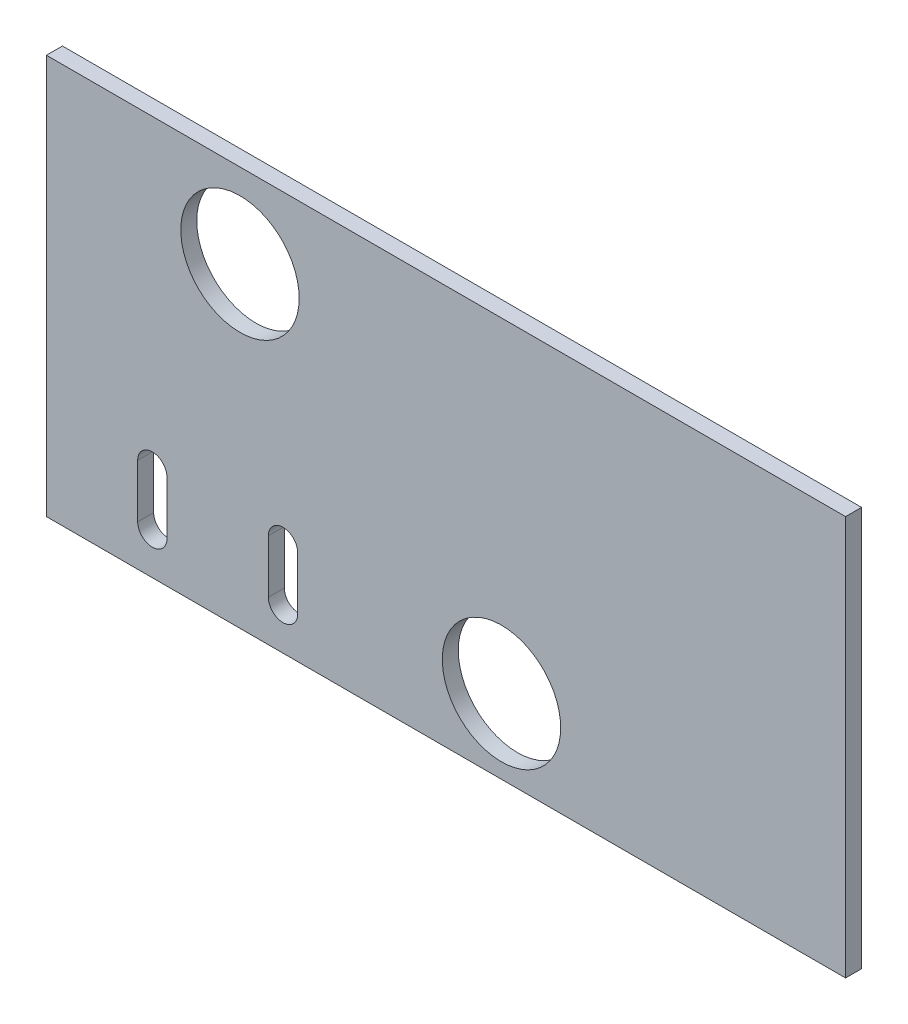
ISO-10303-21;
HEADER;
FILE_DESCRIPTION(('STEP AP214'),'2;1');
FILE_NAME('part.step','',(''),(''),'','','');
FILE_SCHEMA(('AUTOMOTIVE_DESIGN { 1 0 10303 214 1 1 1 1 }'));
ENDSEC;
DATA;
#1=APPLICATION_CONTEXT('core data for automotive mechanical design processes');
#2=APPLICATION_PROTOCOL_DEFINITION('international standard','automotive_design',2000,#1);
#3=PRODUCT_CONTEXT('',#1,'mechanical');
#4=PRODUCT('Part','Part','',(#3));
#5=PRODUCT_RELATED_PRODUCT_CATEGORY('part','',(#4));
#6=PRODUCT_DEFINITION_FORMATION('','',#4);
#7=PRODUCT_DEFINITION_CONTEXT('part definition',#1,'design');
#8=PRODUCT_DEFINITION('design','',#6,#7);
#9=PRODUCT_DEFINITION_SHAPE('','',#8);
#10=(LENGTH_UNIT() NAMED_UNIT(*) SI_UNIT(.MILLI.,.METRE.));
#11=(NAMED_UNIT(*) PLANE_ANGLE_UNIT() SI_UNIT($,.RADIAN.));
#12=(NAMED_UNIT(*) SI_UNIT($,.STERADIAN.) SOLID_ANGLE_UNIT());
#13=UNCERTAINTY_MEASURE_WITH_UNIT(LENGTH_MEASURE(1.E-05),#10,'distance_accuracy_value','');
#14=(GEOMETRIC_REPRESENTATION_CONTEXT(3) GLOBAL_UNCERTAINTY_ASSIGNED_CONTEXT((#13)) GLOBAL_UNIT_ASSIGNED_CONTEXT((#10,
#11,#12)) REPRESENTATION_CONTEXT('',''));
#15=CARTESIAN_POINT('',(0.,0.,0.));
#16=DIRECTION('',(0.,0.,1.));
#17=DIRECTION('',(1.,0.,0.));
#18=AXIS2_PLACEMENT_3D('',#15,#16,#17);
#19=CARTESIAN_POINT('',(0.,0.,3.));
#20=DIRECTION('',(1.,0.,0.));
#21=DIRECTION('',(0.,1.,0.));
#22=AXIS2_PLACEMENT_3D('',#19,#20,#21);
#23=PLANE('',#22);
#24=DIRECTION('',(0.,-1.,0.));
#25=VECTOR('',#24,1.);
#26=CARTESIAN_POINT('',(0.,0.,0.));
#27=LINE('',#26,#25);
#28=CARTESIAN_POINT('',(0.,75.,0.));
#29=VERTEX_POINT('',#28);
#30=CARTESIAN_POINT('',(0.,0.,0.));
#31=VERTEX_POINT('',#30);
#32=EDGE_CURVE('E186',#29,#31,#27,.T.);
#33=ORIENTED_EDGE('',*,*,#32,.T.);
#34=DIRECTION('',(0.,0.,-1.));
#35=VECTOR('',#34,1.);
#36=CARTESIAN_POINT('',(0.,0.,3.));
#37=LINE('',#36,#35);
#38=CARTESIAN_POINT('',(0.,0.,3.));
#39=VERTEX_POINT('',#38);
#40=EDGE_CURVE('E201',#39,#31,#37,.T.);
#41=ORIENTED_EDGE('',*,*,#40,.F.);
#42=DIRECTION('',(0.,-1.,0.));
#43=VECTOR('',#42,1.);
#44=CARTESIAN_POINT('',(0.,0.,3.));
#45=LINE('',#44,#43);
#46=CARTESIAN_POINT('',(0.,75.,3.));
#47=VERTEX_POINT('',#46);
#48=EDGE_CURVE('E177',#47,#39,#45,.T.);
#49=ORIENTED_EDGE('',*,*,#48,.F.);
#50=DIRECTION('',(0.,0.,-1.));
#51=VECTOR('',#50,1.);
#52=CARTESIAN_POINT('',(0.,75.,3.));
#53=LINE('',#52,#51);
#54=EDGE_CURVE('E189',#47,#29,#53,.T.);
#55=ORIENTED_EDGE('',*,*,#54,.T.);
#56=EDGE_LOOP('',(#33,#41,#49,#55));
#57=FACE_BOUND('',#56,.T.);
#58=ADVANCED_FACE('F39',(#57),#23,.F.);
#59=CARTESIAN_POINT('',(0.,0.,3.));
#60=DIRECTION('',(0.,1.,0.));
#61=DIRECTION('',(0.,0.,1.));
#62=AXIS2_PLACEMENT_3D('',#59,#60,#61);
#63=PLANE('',#62);
#64=DIRECTION('',(1.,0.,0.));
#65=VECTOR('',#64,1.);
#66=CARTESIAN_POINT('',(0.,0.,0.));
#67=LINE('',#66,#65);
#68=CARTESIAN_POINT('',(150.,0.,0.));
#69=VERTEX_POINT('',#68);
#70=EDGE_CURVE('E187',#31,#69,#67,.T.);
#71=ORIENTED_EDGE('',*,*,#70,.T.);
#72=DIRECTION('',(0.,0.,-1.));
#73=VECTOR('',#72,1.);
#74=CARTESIAN_POINT('',(150.,0.,3.));
#75=LINE('',#74,#73);
#76=CARTESIAN_POINT('',(150.,0.,3.));
#77=VERTEX_POINT('',#76);
#78=EDGE_CURVE('E199',#77,#69,#75,.T.);
#79=ORIENTED_EDGE('',*,*,#78,.F.);
#80=DIRECTION('',(1.,0.,0.));
#81=VECTOR('',#80,1.);
#82=CARTESIAN_POINT('',(0.,0.,3.));
#83=LINE('',#82,#81);
#84=EDGE_CURVE('E179',#39,#77,#83,.T.);
#85=ORIENTED_EDGE('',*,*,#84,.F.);
#86=ORIENTED_EDGE('',*,*,#40,.T.);
#87=EDGE_LOOP('',(#71,#79,#85,#86));
#88=FACE_BOUND('',#87,.T.);
#89=ADVANCED_FACE('F260',(#88),#63,.F.);
#90=CARTESIAN_POINT('',(150.,0.,3.));
#91=DIRECTION('',(-1.,0.,0.));
#92=DIRECTION('',(0.,-1.,0.));
#93=AXIS2_PLACEMENT_3D('',#90,#91,#92);
#94=PLANE('',#93);
#95=DIRECTION('',(0.,1.,0.));
#96=VECTOR('',#95,1.);
#97=CARTESIAN_POINT('',(150.,0.,0.));
#98=LINE('',#97,#96);
#99=CARTESIAN_POINT('',(150.,75.,0.));
#100=VERTEX_POINT('',#99);
#101=EDGE_CURVE('E195',#69,#100,#98,.T.);
#102=ORIENTED_EDGE('',*,*,#101,.T.);
#103=DIRECTION('',(0.,0.,-1.));
#104=VECTOR('',#103,1.);
#105=CARTESIAN_POINT('',(150.,75.,3.));
#106=LINE('',#105,#104);
#107=CARTESIAN_POINT('',(150.,75.,3.));
#108=VERTEX_POINT('',#107);
#109=EDGE_CURVE('E197',#108,#100,#106,.T.);
#110=ORIENTED_EDGE('',*,*,#109,.F.);
#111=DIRECTION('',(0.,1.,0.));
#112=VECTOR('',#111,1.);
#113=CARTESIAN_POINT('',(150.,0.,3.));
#114=LINE('',#113,#112);
#115=EDGE_CURVE('E185',#77,#108,#114,.T.);
#116=ORIENTED_EDGE('',*,*,#115,.F.);
#117=ORIENTED_EDGE('',*,*,#78,.T.);
#118=EDGE_LOOP('',(#102,#110,#116,#117));
#119=FACE_BOUND('',#118,.T.);
#120=ADVANCED_FACE('F252',(#119),#94,.F.);
#121=CARTESIAN_POINT('',(0.,75.,3.));
#122=DIRECTION('',(0.,-1.,0.));
#123=DIRECTION('',(0.,0.,-1.));
#124=AXIS2_PLACEMENT_3D('',#121,#122,#123);
#125=PLANE('',#124);
#126=DIRECTION('',(-1.,0.,0.));
#127=VECTOR('',#126,1.);
#128=CARTESIAN_POINT('',(0.,75.,0.));
#129=LINE('',#128,#127);
#130=EDGE_CURVE('E176',#100,#29,#129,.T.);
#131=ORIENTED_EDGE('',*,*,#130,.T.);
#132=ORIENTED_EDGE('',*,*,#54,.F.);
#133=DIRECTION('',(-1.,0.,0.));
#134=VECTOR('',#133,1.);
#135=CARTESIAN_POINT('',(0.,75.,3.));
#136=LINE('',#135,#134);
#137=EDGE_CURVE('E184',#108,#47,#136,.T.);
#138=ORIENTED_EDGE('',*,*,#137,.F.);
#139=ORIENTED_EDGE('',*,*,#109,.T.);
#140=EDGE_LOOP('',(#131,#132,#138,#139));
#141=FACE_BOUND('',#140,.T.);
#142=ADVANCED_FACE('F245',(#141),#125,.F.);
#143=CARTESIAN_POINT('',(0.,0.,3.));
#144=DIRECTION('',(0.,0.,-1.));
#145=DIRECTION('',(-1.,0.,0.));
#146=AXIS2_PLACEMENT_3D('',#143,#144,#145);
#147=PLANE('',#146);
#148=CARTESIAN_POINT('',(36.3279104313619,59.2170338531527,3.));
#149=DIRECTION('',(0.,0.,1.));
#150=DIRECTION('',(1.,0.,0.));
#151=AXIS2_PLACEMENT_3D('',#148,#149,#150);
#152=CIRCLE('',#151,11.11);
#153=CARTESIAN_POINT('',(47.4379104313619,59.2170338531527,3.));
#154=VERTEX_POINT('',#153);
#155=EDGE_CURVE('E159',#154,#154,#152,.T.);
#156=ORIENTED_EDGE('',*,*,#155,.F.);
#157=EDGE_LOOP('',(#156));
#158=FACE_BOUND('',#157,.T.);
#159=DIRECTION('',(0.,1.,0.));
#160=VECTOR('',#159,1.);
#161=CARTESIAN_POINT('',(47.1566125130739,7.7184353605162,3.));
#162=LINE('',#161,#160);
#163=CARTESIAN_POINT('',(47.1566125130739,7.7184353605162,3.));
#164=VERTEX_POINT('',#163);
#165=CARTESIAN_POINT('',(47.1566125130739,17.7184353605162,3.));
#166=VERTEX_POINT('',#165);
#167=EDGE_CURVE('E149',#164,#166,#162,.T.);
#168=ORIENTED_EDGE('',*,*,#167,.F.);
#169=CARTESIAN_POINT('',(44.4066125130739,7.7184353605162,3.));
#170=DIRECTION('',(0.,0.,1.));
#171=DIRECTION('',(1.,0.,0.));
#172=AXIS2_PLACEMENT_3D('',#169,#170,#171);
#173=CIRCLE('',#172,2.74999999999999);
#174=CARTESIAN_POINT('',(41.6566125130739,7.7184353605162,3.));
#175=VERTEX_POINT('',#174);
#176=EDGE_CURVE('E53',#175,#164,#173,.T.);
#177=ORIENTED_EDGE('',*,*,#176,.F.);
#178=DIRECTION('',(0.,-1.,0.));
#179=VECTOR('',#178,1.);
#180=CARTESIAN_POINT('',(41.6566125130739,7.7184353605162,3.));
#181=LINE('',#180,#179);
#182=CARTESIAN_POINT('',(41.6566125130739,17.7184353605162,3.));
#183=VERTEX_POINT('',#182);
#184=EDGE_CURVE('E138',#183,#175,#181,.T.);
#185=ORIENTED_EDGE('',*,*,#184,.F.);
#186=CARTESIAN_POINT('',(44.4066125130739,17.7184353605162,3.));
#187=DIRECTION('',(0.,0.,1.));
#188=DIRECTION('',(1.,0.,0.));
#189=AXIS2_PLACEMENT_3D('',#186,#187,#188);
#190=CIRCLE('',#189,2.74999999999999);
#191=EDGE_CURVE('E142',#166,#183,#190,.T.);
#192=ORIENTED_EDGE('',*,*,#191,.F.);
#193=EDGE_LOOP('',(#168,#177,#185,#192));
#194=FACE_BOUND('',#193,.T.);
#195=DIRECTION('',(0.,1.,0.));
#196=VECTOR('',#195,1.);
#197=CARTESIAN_POINT('',(22.6252690103724,7.7184353605162,3.));
#198=LINE('',#197,#196);
#199=CARTESIAN_POINT('',(22.6252690103724,7.7184353605162,3.));
#200=VERTEX_POINT('',#199);
#201=CARTESIAN_POINT('',(22.6252690103724,17.7184353605162,3.));
#202=VERTEX_POINT('',#201);
#203=EDGE_CURVE('E171',#200,#202,#198,.T.);
#204=ORIENTED_EDGE('',*,*,#203,.F.);
#205=CARTESIAN_POINT('',(19.8752690103724,7.7184353605162,3.));
#206=DIRECTION('',(0.,0.,1.));
#207=DIRECTION('',(1.,0.,0.));
#208=AXIS2_PLACEMENT_3D('',#205,#206,#207);
#209=CIRCLE('',#208,2.75);
#210=CARTESIAN_POINT('',(17.1252690103724,7.7184353605162,3.));
#211=VERTEX_POINT('',#210);
#212=EDGE_CURVE('E61',#211,#200,#209,.T.);
#213=ORIENTED_EDGE('',*,*,#212,.F.);
#214=DIRECTION('',(0.,-1.,0.));
#215=VECTOR('',#214,1.);
#216=CARTESIAN_POINT('',(17.1252690103724,7.7184353605162,3.));
#217=LINE('',#216,#215);
#218=CARTESIAN_POINT('',(17.1252690103724,17.7184353605162,3.));
#219=VERTEX_POINT('',#218);
#220=EDGE_CURVE('E162',#219,#211,#217,.T.);
#221=ORIENTED_EDGE('',*,*,#220,.F.);
#222=CARTESIAN_POINT('',(19.8752690103724,17.7184353605162,3.));
#223=DIRECTION('',(0.,0.,1.));
#224=DIRECTION('',(1.,0.,0.));
#225=AXIS2_PLACEMENT_3D('',#222,#223,#224);
#226=CIRCLE('',#225,2.75);
#227=EDGE_CURVE('E166',#202,#219,#226,.T.);
#228=ORIENTED_EDGE('',*,*,#227,.F.);
#229=EDGE_LOOP('',(#204,#213,#221,#228));
#230=FACE_BOUND('',#229,.T.);
#231=CARTESIAN_POINT('',(85.413576885498,13.9491414565635,3.));
#232=DIRECTION('',(0.,0.,1.));
#233=DIRECTION('',(1.,0.,0.));
#234=AXIS2_PLACEMENT_3D('',#231,#232,#233);
#235=CIRCLE('',#234,11.11);
#236=CARTESIAN_POINT('',(96.523576885498,13.9491414565635,3.));
#237=VERTEX_POINT('',#236);
#238=EDGE_CURVE('E160',#237,#237,#235,.T.);
#239=ORIENTED_EDGE('',*,*,#238,.F.);
#240=EDGE_LOOP('',(#239));
#241=FACE_BOUND('',#240,.T.);
#242=ORIENTED_EDGE('',*,*,#48,.T.);
#243=ORIENTED_EDGE('',*,*,#84,.T.);
#244=ORIENTED_EDGE('',*,*,#115,.T.);
#245=ORIENTED_EDGE('',*,*,#137,.T.);
#246=EDGE_LOOP('',(#242,#243,#244,#245));
#247=FACE_BOUND('',#246,.T.);
#248=ADVANCED_FACE('F148',(#158,#194,#230,#241,#247),#147,.F.);
#249=CARTESIAN_POINT('',(0.,0.,0.));
#250=DIRECTION('',(0.,0.,-1.));
#251=DIRECTION('',(-1.,0.,0.));
#252=AXIS2_PLACEMENT_3D('',#249,#250,#251);
#253=PLANE('',#252);
#254=CARTESIAN_POINT('',(36.3279104313619,59.2170338531527,0.));
#255=DIRECTION('',(0.,0.,-1.));
#256=DIRECTION('',(-1.,0.,0.));
#257=AXIS2_PLACEMENT_3D('',#254,#255,#256);
#258=CIRCLE('',#257,11.11);
#259=CARTESIAN_POINT('',(25.2179104313619,59.2170338531527,0.));
#260=VERTEX_POINT('',#259);
#261=EDGE_CURVE('E45',#260,#260,#258,.T.);
#262=ORIENTED_EDGE('',*,*,#261,.F.);
#263=EDGE_LOOP('',(#262));
#264=FACE_BOUND('',#263,.T.);
#265=CARTESIAN_POINT('',(44.4066125130739,7.7184353605162,0.));
#266=DIRECTION('',(0.,0.,-1.));
#267=DIRECTION('',(-1.,0.,0.));
#268=AXIS2_PLACEMENT_3D('',#265,#266,#267);
#269=CIRCLE('',#268,2.74999999999999);
#270=CARTESIAN_POINT('',(47.1566125130739,7.7184353605162,0.));
#271=VERTEX_POINT('',#270);
#272=CARTESIAN_POINT('',(41.6566125130739,7.7184353605162,0.));
#273=VERTEX_POINT('',#272);
#274=EDGE_CURVE('E11',#271,#273,#269,.T.);
#275=ORIENTED_EDGE('',*,*,#274,.F.);
#276=DIRECTION('',(0.,-1.,0.));
#277=VECTOR('',#276,1.);
#278=CARTESIAN_POINT('',(47.1566125130739,0.,0.));
#279=LINE('',#278,#277);
#280=CARTESIAN_POINT('',(47.1566125130739,17.7184353605162,0.));
#281=VERTEX_POINT('',#280);
#282=EDGE_CURVE('E217',#281,#271,#279,.T.);
#283=ORIENTED_EDGE('',*,*,#282,.F.);
#284=CARTESIAN_POINT('',(44.4066125130739,17.7184353605162,0.));
#285=DIRECTION('',(0.,0.,-1.));
#286=DIRECTION('',(-1.,0.,0.));
#287=AXIS2_PLACEMENT_3D('',#284,#285,#286);
#288=CIRCLE('',#287,2.74999999999999);
#289=CARTESIAN_POINT('',(41.6566125130739,17.7184353605162,0.));
#290=VERTEX_POINT('',#289);
#291=EDGE_CURVE('E219',#290,#281,#288,.T.);
#292=ORIENTED_EDGE('',*,*,#291,.F.);
#293=DIRECTION('',(0.,1.,0.));
#294=VECTOR('',#293,1.);
#295=CARTESIAN_POINT('',(41.6566125130739,0.,0.));
#296=LINE('',#295,#294);
#297=EDGE_CURVE('E50',#273,#290,#296,.T.);
#298=ORIENTED_EDGE('',*,*,#297,.F.);
#299=EDGE_LOOP('',(#275,#283,#292,#298));
#300=FACE_BOUND('',#299,.T.);
#301=CARTESIAN_POINT('',(19.8752690103724,7.7184353605162,0.));
#302=DIRECTION('',(0.,0.,-1.));
#303=DIRECTION('',(-1.,0.,0.));
#304=AXIS2_PLACEMENT_3D('',#301,#302,#303);
#305=CIRCLE('',#304,2.75);
#306=CARTESIAN_POINT('',(22.6252690103724,7.7184353605162,0.));
#307=VERTEX_POINT('',#306);
#308=CARTESIAN_POINT('',(17.1252690103724,7.7184353605162,0.));
#309=VERTEX_POINT('',#308);
#310=EDGE_CURVE('E216',#307,#309,#305,.T.);
#311=ORIENTED_EDGE('',*,*,#310,.F.);
#312=DIRECTION('',(0.,-1.,0.));
#313=VECTOR('',#312,1.);
#314=CARTESIAN_POINT('',(22.6252690103724,0.,0.));
#315=LINE('',#314,#313);
#316=CARTESIAN_POINT('',(22.6252690103724,17.7184353605162,0.));
#317=VERTEX_POINT('',#316);
#318=EDGE_CURVE('E206',#317,#307,#315,.T.);
#319=ORIENTED_EDGE('',*,*,#318,.F.);
#320=CARTESIAN_POINT('',(19.8752690103724,17.7184353605162,0.));
#321=DIRECTION('',(0.,0.,-1.));
#322=DIRECTION('',(-1.,0.,0.));
#323=AXIS2_PLACEMENT_3D('',#320,#321,#322);
#324=CIRCLE('',#323,2.75);
#325=CARTESIAN_POINT('',(17.1252690103724,17.7184353605162,0.));
#326=VERTEX_POINT('',#325);
#327=EDGE_CURVE('E211',#326,#317,#324,.T.);
#328=ORIENTED_EDGE('',*,*,#327,.F.);
#329=DIRECTION('',(0.,1.,0.));
#330=VECTOR('',#329,1.);
#331=CARTESIAN_POINT('',(17.1252690103724,0.,0.));
#332=LINE('',#331,#330);
#333=EDGE_CURVE('E212',#309,#326,#332,.T.);
#334=ORIENTED_EDGE('',*,*,#333,.F.);
#335=EDGE_LOOP('',(#311,#319,#328,#334));
#336=FACE_BOUND('',#335,.T.);
#337=CARTESIAN_POINT('',(85.413576885498,13.9491414565635,0.));
#338=DIRECTION('',(0.,0.,-1.));
#339=DIRECTION('',(-1.,0.,0.));
#340=AXIS2_PLACEMENT_3D('',#337,#338,#339);
#341=CIRCLE('',#340,11.11);
#342=CARTESIAN_POINT('',(74.303576885498,13.9491414565635,0.));
#343=VERTEX_POINT('',#342);
#344=EDGE_CURVE('E210',#343,#343,#341,.T.);
#345=ORIENTED_EDGE('',*,*,#344,.F.);
#346=EDGE_LOOP('',(#345));
#347=FACE_BOUND('',#346,.T.);
#348=ORIENTED_EDGE('',*,*,#32,.F.);
#349=ORIENTED_EDGE('',*,*,#130,.F.);
#350=ORIENTED_EDGE('',*,*,#101,.F.);
#351=ORIENTED_EDGE('',*,*,#70,.F.);
#352=EDGE_LOOP('',(#348,#349,#350,#351));
#353=FACE_BOUND('',#352,.T.);
#354=ADVANCED_FACE('F227',(#264,#300,#336,#347,#353),#253,.T.);
#355=CARTESIAN_POINT('',(85.413576885498,13.9491414565635,-7.));
#356=DIRECTION('',(0.,0.,1.));
#357=DIRECTION('',(1.,0.,0.));
#358=AXIS2_PLACEMENT_3D('',#355,#356,#357);
#359=CYLINDRICAL_SURFACE('',#358,11.11);
#360=ORIENTED_EDGE('',*,*,#344,.T.);
#361=EDGE_LOOP('',(#360));
#362=FACE_BOUND('',#361,.T.);
#363=ORIENTED_EDGE('',*,*,#238,.T.);
#364=EDGE_LOOP('',(#363));
#365=FACE_BOUND('',#364,.T.);
#366=ADVANCED_FACE('F247',(#362,#365),#359,.F.);
#367=CARTESIAN_POINT('',(19.8752690103724,7.7184353605162,-7.));
#368=DIRECTION('',(0.,0.,1.));
#369=DIRECTION('',(1.,0.,0.));
#370=AXIS2_PLACEMENT_3D('',#367,#368,#369);
#371=CYLINDRICAL_SURFACE('',#370,2.75);
#372=ORIENTED_EDGE('',*,*,#310,.T.);
#373=DIRECTION('',(0.,0.,1.));
#374=VECTOR('',#373,1.);
#375=CARTESIAN_POINT('',(17.1252690103724,7.7184353605162,-7.));
#376=LINE('',#375,#374);
#377=EDGE_CURVE('E147',#309,#211,#376,.T.);
#378=ORIENTED_EDGE('',*,*,#377,.T.);
#379=ORIENTED_EDGE('',*,*,#212,.T.);
#380=DIRECTION('',(0.,0.,1.));
#381=VECTOR('',#380,1.);
#382=CARTESIAN_POINT('',(22.6252690103724,7.7184353605162,-7.));
#383=LINE('',#382,#381);
#384=EDGE_CURVE('E161',#307,#200,#383,.T.);
#385=ORIENTED_EDGE('',*,*,#384,.F.);
#386=EDGE_LOOP('',(#372,#378,#379,#385));
#387=FACE_BOUND('',#386,.T.);
#388=ADVANCED_FACE('F307',(#387),#371,.F.);
#389=CARTESIAN_POINT('',(17.1252690103724,7.7184353605162,-7.));
#390=DIRECTION('',(-1.,0.,0.));
#391=DIRECTION('',(0.,0.,1.));
#392=AXIS2_PLACEMENT_3D('',#389,#390,#391);
#393=PLANE('',#392);
#394=ORIENTED_EDGE('',*,*,#333,.T.);
#395=DIRECTION('',(0.,0.,1.));
#396=VECTOR('',#395,1.);
#397=CARTESIAN_POINT('',(17.1252690103724,17.7184353605162,-7.));
#398=LINE('',#397,#396);
#399=EDGE_CURVE('E155',#326,#219,#398,.T.);
#400=ORIENTED_EDGE('',*,*,#399,.T.);
#401=ORIENTED_EDGE('',*,*,#220,.T.);
#402=ORIENTED_EDGE('',*,*,#377,.F.);
#403=EDGE_LOOP('',(#394,#400,#401,#402));
#404=FACE_BOUND('',#403,.T.);
#405=ADVANCED_FACE('F320',(#404),#393,.F.);
#406=CARTESIAN_POINT('',(19.8752690103724,17.7184353605162,-7.));
#407=DIRECTION('',(0.,0.,1.));
#408=DIRECTION('',(1.,0.,0.));
#409=AXIS2_PLACEMENT_3D('',#406,#407,#408);
#410=CYLINDRICAL_SURFACE('',#409,2.75);
#411=ORIENTED_EDGE('',*,*,#327,.T.);
#412=DIRECTION('',(0.,0.,1.));
#413=VECTOR('',#412,1.);
#414=CARTESIAN_POINT('',(22.6252690103724,17.7184353605162,-7.));
#415=LINE('',#414,#413);
#416=EDGE_CURVE('E163',#317,#202,#415,.T.);
#417=ORIENTED_EDGE('',*,*,#416,.T.);
#418=ORIENTED_EDGE('',*,*,#227,.T.);
#419=ORIENTED_EDGE('',*,*,#399,.F.);
#420=EDGE_LOOP('',(#411,#417,#418,#419));
#421=FACE_BOUND('',#420,.T.);
#422=ADVANCED_FACE('F326',(#421),#410,.F.);
#423=CARTESIAN_POINT('',(22.6252690103724,7.7184353605162,-7.));
#424=DIRECTION('',(1.,0.,0.));
#425=DIRECTION('',(0.,0.,-1.));
#426=AXIS2_PLACEMENT_3D('',#423,#424,#425);
#427=PLANE('',#426);
#428=ORIENTED_EDGE('',*,*,#318,.T.);
#429=ORIENTED_EDGE('',*,*,#384,.T.);
#430=ORIENTED_EDGE('',*,*,#203,.T.);
#431=ORIENTED_EDGE('',*,*,#416,.F.);
#432=EDGE_LOOP('',(#428,#429,#430,#431));
#433=FACE_BOUND('',#432,.T.);
#434=ADVANCED_FACE('F333',(#433),#427,.F.);
#435=CARTESIAN_POINT('',(44.4066125130739,7.7184353605162,-7.));
#436=DIRECTION('',(0.,0.,1.));
#437=DIRECTION('',(1.,0.,0.));
#438=AXIS2_PLACEMENT_3D('',#435,#436,#437);
#439=CYLINDRICAL_SURFACE('',#438,2.74999999999999);
#440=ORIENTED_EDGE('',*,*,#274,.T.);
#441=DIRECTION('',(0.,0.,1.));
#442=VECTOR('',#441,1.);
#443=CARTESIAN_POINT('',(41.6566125130739,7.7184353605162,-7.));
#444=LINE('',#443,#442);
#445=EDGE_CURVE('E130',#273,#175,#444,.T.);
#446=ORIENTED_EDGE('',*,*,#445,.T.);
#447=ORIENTED_EDGE('',*,*,#176,.T.);
#448=DIRECTION('',(0.,0.,1.));
#449=VECTOR('',#448,1.);
#450=CARTESIAN_POINT('',(47.1566125130739,7.7184353605162,-7.));
#451=LINE('',#450,#449);
#452=EDGE_CURVE('E141',#271,#164,#451,.T.);
#453=ORIENTED_EDGE('',*,*,#452,.F.);
#454=EDGE_LOOP('',(#440,#446,#447,#453));
#455=FACE_BOUND('',#454,.T.);
#456=ADVANCED_FACE('F129',(#455),#439,.F.);
#457=CARTESIAN_POINT('',(41.6566125130739,7.7184353605162,-7.));
#458=DIRECTION('',(-1.,0.,0.));
#459=DIRECTION('',(0.,0.,1.));
#460=AXIS2_PLACEMENT_3D('',#457,#458,#459);
#461=PLANE('',#460);
#462=ORIENTED_EDGE('',*,*,#297,.T.);
#463=DIRECTION('',(0.,0.,1.));
#464=VECTOR('',#463,1.);
#465=CARTESIAN_POINT('',(41.6566125130739,17.7184353605162,-7.));
#466=LINE('',#465,#464);
#467=EDGE_CURVE('E135',#290,#183,#466,.T.);
#468=ORIENTED_EDGE('',*,*,#467,.T.);
#469=ORIENTED_EDGE('',*,*,#184,.T.);
#470=ORIENTED_EDGE('',*,*,#445,.F.);
#471=EDGE_LOOP('',(#462,#468,#469,#470));
#472=FACE_BOUND('',#471,.T.);
#473=ADVANCED_FACE('F140',(#472),#461,.F.);
#474=CARTESIAN_POINT('',(44.4066125130739,17.7184353605162,-7.));
#475=DIRECTION('',(0.,0.,1.));
#476=DIRECTION('',(1.,0.,0.));
#477=AXIS2_PLACEMENT_3D('',#474,#475,#476);
#478=CYLINDRICAL_SURFACE('',#477,2.74999999999999);
#479=ORIENTED_EDGE('',*,*,#291,.T.);
#480=DIRECTION('',(0.,0.,1.));
#481=VECTOR('',#480,1.);
#482=CARTESIAN_POINT('',(47.1566125130739,17.7184353605162,-7.));
#483=LINE('',#482,#481);
#484=EDGE_CURVE('E230',#281,#166,#483,.T.);
#485=ORIENTED_EDGE('',*,*,#484,.T.);
#486=ORIENTED_EDGE('',*,*,#191,.T.);
#487=ORIENTED_EDGE('',*,*,#467,.F.);
#488=EDGE_LOOP('',(#479,#485,#486,#487));
#489=FACE_BOUND('',#488,.T.);
#490=ADVANCED_FACE('F229',(#489),#478,.F.);
#491=CARTESIAN_POINT('',(47.1566125130739,7.7184353605162,-7.));
#492=DIRECTION('',(1.,0.,0.));
#493=DIRECTION('',(0.,0.,-1.));
#494=AXIS2_PLACEMENT_3D('',#491,#492,#493);
#495=PLANE('',#494);
#496=ORIENTED_EDGE('',*,*,#282,.T.);
#497=ORIENTED_EDGE('',*,*,#452,.T.);
#498=ORIENTED_EDGE('',*,*,#167,.T.);
#499=ORIENTED_EDGE('',*,*,#484,.F.);
#500=EDGE_LOOP('',(#496,#497,#498,#499));
#501=FACE_BOUND('',#500,.T.);
#502=ADVANCED_FACE('F233',(#501),#495,.F.);
#503=CARTESIAN_POINT('',(36.3279104313619,59.2170338531527,-7.));
#504=DIRECTION('',(0.,0.,1.));
#505=DIRECTION('',(1.,0.,0.));
#506=AXIS2_PLACEMENT_3D('',#503,#504,#505);
#507=CYLINDRICAL_SURFACE('',#506,11.11);
#508=ORIENTED_EDGE('',*,*,#261,.T.);
#509=EDGE_LOOP('',(#508));
#510=FACE_BOUND('',#509,.T.);
#511=ORIENTED_EDGE('',*,*,#155,.T.);
#512=EDGE_LOOP('',(#511));
#513=FACE_BOUND('',#512,.T.);
#514=ADVANCED_FACE('F238',(#510,#513),#507,.F.);
#515=CLOSED_SHELL('',(#58,#89,#120,#142,#248,#354,#366,#388,#405,#422,#434,#456,#473,#490,#502,#514));
#516=MANIFOLD_SOLID_BREP('B2',#515);
#517=ADVANCED_BREP_SHAPE_REPRESENTATION('',(#18,#516),#14);
#518=SHAPE_DEFINITION_REPRESENTATION(#9,#517);
ENDSEC;
END-ISO-10303-21;
